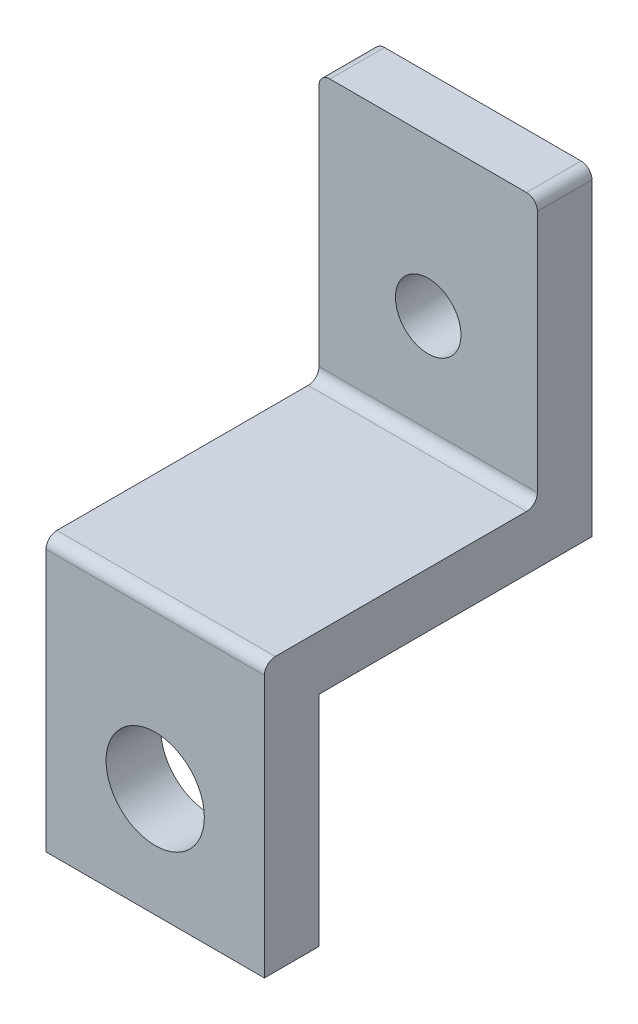
ISO-10303-21;
HEADER;
FILE_DESCRIPTION(('STEP AP214'),'2;1');
FILE_NAME('part.step','',(''),(''),'','','');
FILE_SCHEMA(('AUTOMOTIVE_DESIGN { 1 0 10303 214 1 1 1 1 }'));
ENDSEC;
DATA;
#1=APPLICATION_CONTEXT('core data for automotive mechanical design processes');
#2=APPLICATION_PROTOCOL_DEFINITION('international standard','automotive_design',2000,#1);
#3=PRODUCT_CONTEXT('',#1,'mechanical');
#4=PRODUCT('Part','Part','',(#3));
#5=PRODUCT_RELATED_PRODUCT_CATEGORY('part','',(#4));
#6=PRODUCT_DEFINITION_FORMATION('','',#4);
#7=PRODUCT_DEFINITION_CONTEXT('part definition',#1,'design');
#8=PRODUCT_DEFINITION('design','',#6,#7);
#9=PRODUCT_DEFINITION_SHAPE('','',#8);
#10=(LENGTH_UNIT() NAMED_UNIT(*) SI_UNIT(.MILLI.,.METRE.));
#11=(NAMED_UNIT(*) PLANE_ANGLE_UNIT() SI_UNIT($,.RADIAN.));
#12=(NAMED_UNIT(*) SI_UNIT($,.STERADIAN.) SOLID_ANGLE_UNIT());
#13=UNCERTAINTY_MEASURE_WITH_UNIT(LENGTH_MEASURE(1.E-05),#10,'distance_accuracy_value','');
#14=(GEOMETRIC_REPRESENTATION_CONTEXT(3) GLOBAL_UNCERTAINTY_ASSIGNED_CONTEXT((#13)) GLOBAL_UNIT_ASSIGNED_CONTEXT((#10,
#11,#12)) REPRESENTATION_CONTEXT('',''));
#15=CARTESIAN_POINT('',(0.,0.,0.));
#16=DIRECTION('',(0.,0.,1.));
#17=DIRECTION('',(1.,0.,0.));
#18=AXIS2_PLACEMENT_3D('',#15,#16,#17);
#19=CARTESIAN_POINT('',(0.,0.,0.));
#20=DIRECTION('',(0.,0.,1.));
#21=DIRECTION('',(1.,0.,0.));
#22=AXIS2_PLACEMENT_3D('',#19,#20,#21);
#23=PLANE('',#22);
#24=CARTESIAN_POINT('',(0.,0.,0.));
#25=DIRECTION('',(0.,0.,1.));
#26=DIRECTION('',(1.,0.,0.));
#27=AXIS2_PLACEMENT_3D('',#24,#25,#26);
#28=CIRCLE('',#27,4.5);
#29=CARTESIAN_POINT('',(4.5,0.,0.));
#30=VERTEX_POINT('',#29);
#31=EDGE_CURVE('E149',#30,#30,#28,.T.);
#32=ORIENTED_EDGE('',*,*,#31,.T.);
#33=EDGE_LOOP('',(#32));
#34=FACE_BOUND('',#33,.T.);
#35=DIRECTION('',(-1.,0.,0.));
#36=VECTOR('',#35,1.);
#37=CARTESIAN_POINT('',(10.,10.,0.));
#38=LINE('',#37,#36);
#39=CARTESIAN_POINT('',(10.,10.,0.));
#40=VERTEX_POINT('',#39);
#41=CARTESIAN_POINT('',(-9.99999999999999,10.,0.));
#42=VERTEX_POINT('',#41);
#43=EDGE_CURVE('E159',#40,#42,#38,.T.);
#44=ORIENTED_EDGE('',*,*,#43,.F.);
#45=DIRECTION('',(0.,1.,0.));
#46=VECTOR('',#45,1.);
#47=CARTESIAN_POINT('',(9.99999999999999,39.3,0.));
#48=LINE('',#47,#46);
#49=CARTESIAN_POINT('',(10.,-10.,0.));
#50=VERTEX_POINT('',#49);
#51=EDGE_CURVE('E146',#50,#40,#48,.T.);
#52=ORIENTED_EDGE('',*,*,#51,.F.);
#53=DIRECTION('',(1.,0.,0.));
#54=VECTOR('',#53,1.);
#55=CARTESIAN_POINT('',(-10.,-10.,0.));
#56=LINE('',#55,#54);
#57=CARTESIAN_POINT('',(-10.,-10.,0.));
#58=VERTEX_POINT('',#57);
#59=EDGE_CURVE('E171',#58,#50,#56,.T.);
#60=ORIENTED_EDGE('',*,*,#59,.F.);
#61=DIRECTION('',(0.,-1.,0.));
#62=VECTOR('',#61,1.);
#63=CARTESIAN_POINT('',(-10.,10.,0.));
#64=LINE('',#63,#62);
#65=EDGE_CURVE('E177',#42,#58,#64,.T.);
#66=ORIENTED_EDGE('',*,*,#65,.F.);
#67=EDGE_LOOP('',(#44,#52,#60,#66));
#68=FACE_BOUND('',#67,.T.);
#69=ADVANCED_FACE('F41',(#34,#68),#23,.F.);
#70=CARTESIAN_POINT('',(0.,0.,5.));
#71=DIRECTION('',(0.,0.,1.));
#72=DIRECTION('',(1.,0.,0.));
#73=AXIS2_PLACEMENT_3D('',#70,#71,#72);
#74=PLANE('',#73);
#75=DIRECTION('',(0.,1.,0.));
#76=VECTOR('',#75,1.);
#77=CARTESIAN_POINT('',(10.,10.,5.));
#78=LINE('',#77,#76);
#79=CARTESIAN_POINT('',(10.,-10.,5.));
#80=VERTEX_POINT('',#79);
#81=CARTESIAN_POINT('',(10.,14.,5.));
#82=VERTEX_POINT('',#81);
#83=EDGE_CURVE('E168',#80,#82,#78,.T.);
#84=ORIENTED_EDGE('',*,*,#83,.T.);
#85=DIRECTION('',(1.,0.,0.));
#86=VECTOR('',#85,1.);
#87=CARTESIAN_POINT('',(-10.,14.,5.));
#88=LINE('',#87,#86);
#89=CARTESIAN_POINT('',(-10.,14.,5.));
#90=VERTEX_POINT('',#89);
#91=EDGE_CURVE('E56',#82,#90,#88,.F.);
#92=ORIENTED_EDGE('',*,*,#91,.T.);
#93=DIRECTION('',(0.,-1.,0.));
#94=VECTOR('',#93,1.);
#95=CARTESIAN_POINT('',(-10.,39.3,5.));
#96=LINE('',#95,#94);
#97=CARTESIAN_POINT('',(-10.,-10.,5.));
#98=VERTEX_POINT('',#97);
#99=EDGE_CURVE('E170',#90,#98,#96,.T.);
#100=ORIENTED_EDGE('',*,*,#99,.T.);
#101=DIRECTION('',(1.,0.,0.));
#102=VECTOR('',#101,1.);
#103=CARTESIAN_POINT('',(-10.,-10.,5.));
#104=LINE('',#103,#102);
#105=EDGE_CURVE('E173',#98,#80,#104,.T.);
#106=ORIENTED_EDGE('',*,*,#105,.T.);
#107=EDGE_LOOP('',(#84,#92,#100,#106));
#108=FACE_BOUND('',#107,.T.);
#109=CARTESIAN_POINT('',(0.,0.,5.));
#110=DIRECTION('',(0.,0.,1.));
#111=DIRECTION('',(1.,0.,0.));
#112=AXIS2_PLACEMENT_3D('',#109,#110,#111);
#113=CIRCLE('',#112,4.5);
#114=CARTESIAN_POINT('',(4.5,0.,5.));
#115=VERTEX_POINT('',#114);
#116=EDGE_CURVE('E163',#115,#115,#113,.T.);
#117=ORIENTED_EDGE('',*,*,#116,.F.);
#118=EDGE_LOOP('',(#117));
#119=FACE_BOUND('',#118,.T.);
#120=ADVANCED_FACE('F271',(#108,#119),#74,.T.);
#121=CARTESIAN_POINT('',(9.99999999999999,39.3,5.));
#122=DIRECTION('',(-1.,0.,0.));
#123=DIRECTION('',(0.,-1.,0.));
#124=AXIS2_PLACEMENT_3D('',#121,#122,#123);
#125=PLANE('',#124);
#126=DIRECTION('',(0.,-1.,0.));
#127=VECTOR('',#126,1.);
#128=CARTESIAN_POINT('',(10.,39.3,-25.));
#129=LINE('',#128,#127);
#130=CARTESIAN_POINT('',(10.,38.3,-25.));
#131=VERTEX_POINT('',#130);
#132=CARTESIAN_POINT('',(10.,10.,-25.));
#133=VERTEX_POINT('',#132);
#134=EDGE_CURVE('E129',#131,#133,#129,.T.);
#135=ORIENTED_EDGE('',*,*,#134,.F.);
#136=DIRECTION('',(0.,0.,-1.));
#137=VECTOR('',#136,1.);
#138=CARTESIAN_POINT('',(9.99999999999999,38.3,5.));
#139=LINE('',#138,#137);
#140=CARTESIAN_POINT('',(10.,38.3,-20.));
#141=VERTEX_POINT('',#140);
#142=EDGE_CURVE('E212',#131,#141,#139,.F.);
#143=ORIENTED_EDGE('',*,*,#142,.T.);
#144=DIRECTION('',(0.,1.,0.));
#145=VECTOR('',#144,1.);
#146=CARTESIAN_POINT('',(10.,39.3,-20.));
#147=LINE('',#146,#145);
#148=CARTESIAN_POINT('',(10.,16.,-20.));
#149=VERTEX_POINT('',#148);
#150=EDGE_CURVE('E223',#149,#141,#147,.T.);
#151=ORIENTED_EDGE('',*,*,#150,.F.);
#152=CARTESIAN_POINT('',(9.99999999999999,16.,-19.));
#153=DIRECTION('',(-1.,0.,0.));
#154=DIRECTION('',(0.,-1.,0.));
#155=AXIS2_PLACEMENT_3D('',#152,#153,#154);
#156=CIRCLE('',#155,1.);
#157=CARTESIAN_POINT('',(10.,15.,-19.));
#158=VERTEX_POINT('',#157);
#159=EDGE_CURVE('E49',#149,#158,#156,.T.);
#160=ORIENTED_EDGE('',*,*,#159,.T.);
#161=DIRECTION('',(0.,0.,-1.));
#162=VECTOR('',#161,1.);
#163=CARTESIAN_POINT('',(10.,15.,0.));
#164=LINE('',#163,#162);
#165=CARTESIAN_POINT('',(10.,15.,4.));
#166=VERTEX_POINT('',#165);
#167=EDGE_CURVE('E221',#166,#158,#164,.T.);
#168=ORIENTED_EDGE('',*,*,#167,.F.);
#169=CARTESIAN_POINT('',(10.,14.,4.));
#170=DIRECTION('',(-1.,0.,0.));
#171=DIRECTION('',(0.,-1.,0.));
#172=AXIS2_PLACEMENT_3D('',#169,#170,#171);
#173=CIRCLE('',#172,1.);
#174=EDGE_CURVE('E64',#166,#82,#173,.F.);
#175=ORIENTED_EDGE('',*,*,#174,.T.);
#176=ORIENTED_EDGE('',*,*,#83,.F.);
#177=DIRECTION('',(0.,0.,-1.));
#178=VECTOR('',#177,1.);
#179=CARTESIAN_POINT('',(10.,-10.,5.));
#180=LINE('',#179,#178);
#181=EDGE_CURVE('E175',#80,#50,#180,.T.);
#182=ORIENTED_EDGE('',*,*,#181,.T.);
#183=ORIENTED_EDGE('',*,*,#51,.T.);
#184=DIRECTION('',(0.,0.,1.));
#185=VECTOR('',#184,1.);
#186=CARTESIAN_POINT('',(10.,10.,-25.));
#187=LINE('',#186,#185);
#188=EDGE_CURVE('E143',#133,#40,#187,.T.);
#189=ORIENTED_EDGE('',*,*,#188,.F.);
#190=EDGE_LOOP('',(#135,#143,#151,#160,#168,#175,#176,#182,#183,#189));
#191=FACE_BOUND('',#190,.T.);
#192=ADVANCED_FACE('F144',(#191),#125,.F.);
#193=CARTESIAN_POINT('',(9.99999999999999,39.3,5.));
#194=DIRECTION('',(0.,-1.,0.));
#195=DIRECTION('',(0.,0.,-1.));
#196=AXIS2_PLACEMENT_3D('',#193,#194,#195);
#197=PLANE('',#196);
#198=DIRECTION('',(1.,0.,0.));
#199=VECTOR('',#198,1.);
#200=CARTESIAN_POINT('',(-20.,39.3,-20.));
#201=LINE('',#200,#199);
#202=CARTESIAN_POINT('',(-9.00000000000001,39.3,-20.));
#203=VERTEX_POINT('',#202);
#204=CARTESIAN_POINT('',(8.99999999999999,39.3,-20.));
#205=VERTEX_POINT('',#204);
#206=EDGE_CURVE('E161',#203,#205,#201,.T.);
#207=ORIENTED_EDGE('',*,*,#206,.T.);
#208=DIRECTION('',(0.,0.,-1.));
#209=VECTOR('',#208,1.);
#210=CARTESIAN_POINT('',(8.99999999999999,39.3,5.));
#211=LINE('',#210,#209);
#212=CARTESIAN_POINT('',(8.99999999999999,39.3,-25.));
#213=VERTEX_POINT('',#212);
#214=EDGE_CURVE('E205',#205,#213,#211,.T.);
#215=ORIENTED_EDGE('',*,*,#214,.T.);
#216=DIRECTION('',(1.,0.,0.));
#217=VECTOR('',#216,1.);
#218=CARTESIAN_POINT('',(10.,39.3,-25.));
#219=LINE('',#218,#217);
#220=CARTESIAN_POINT('',(-9.00000000000001,39.3,-25.));
#221=VERTEX_POINT('',#220);
#222=EDGE_CURVE('E139',#221,#213,#219,.T.);
#223=ORIENTED_EDGE('',*,*,#222,.F.);
#224=DIRECTION('',(0.,0.,-1.));
#225=VECTOR('',#224,1.);
#226=CARTESIAN_POINT('',(-9.00000000000001,39.3,5.));
#227=LINE('',#226,#225);
#228=EDGE_CURVE('E203',#221,#203,#227,.F.);
#229=ORIENTED_EDGE('',*,*,#228,.T.);
#230=EDGE_LOOP('',(#207,#215,#223,#229));
#231=FACE_BOUND('',#230,.T.);
#232=ADVANCED_FACE('F288',(#231),#197,.F.);
#233=CARTESIAN_POINT('',(-10.,10.,5.));
#234=DIRECTION('',(1.,0.,0.));
#235=DIRECTION('',(0.,1.,0.));
#236=AXIS2_PLACEMENT_3D('',#233,#234,#235);
#237=PLANE('',#236);
#238=DIRECTION('',(0.,1.,0.));
#239=VECTOR('',#238,1.);
#240=CARTESIAN_POINT('',(-10.,10.,-20.));
#241=LINE('',#240,#239);
#242=CARTESIAN_POINT('',(-10.,16.,-20.));
#243=VERTEX_POINT('',#242);
#244=CARTESIAN_POINT('',(-10.,38.3,-20.));
#245=VERTEX_POINT('',#244);
#246=EDGE_CURVE('E185',#243,#245,#241,.T.);
#247=ORIENTED_EDGE('',*,*,#246,.T.);
#248=DIRECTION('',(0.,0.,-1.));
#249=VECTOR('',#248,1.);
#250=CARTESIAN_POINT('',(-10.,38.3,5.));
#251=LINE('',#250,#249);
#252=CARTESIAN_POINT('',(-9.99999999999999,38.3,-25.));
#253=VERTEX_POINT('',#252);
#254=EDGE_CURVE('E216',#245,#253,#251,.T.);
#255=ORIENTED_EDGE('',*,*,#254,.T.);
#256=DIRECTION('',(0.,1.,0.));
#257=VECTOR('',#256,1.);
#258=CARTESIAN_POINT('',(-9.99999999999999,39.3,-25.));
#259=LINE('',#258,#257);
#260=CARTESIAN_POINT('',(-9.99999999999999,10.,-25.));
#261=VERTEX_POINT('',#260);
#262=EDGE_CURVE('E160',#261,#253,#259,.T.);
#263=ORIENTED_EDGE('',*,*,#262,.F.);
#264=DIRECTION('',(0.,0.,1.));
#265=VECTOR('',#264,1.);
#266=CARTESIAN_POINT('',(-9.99999999999999,10.,-25.));
#267=LINE('',#266,#265);
#268=EDGE_CURVE('E150',#261,#42,#267,.T.);
#269=ORIENTED_EDGE('',*,*,#268,.T.);
#270=ORIENTED_EDGE('',*,*,#65,.T.);
#271=DIRECTION('',(0.,0.,-1.));
#272=VECTOR('',#271,1.);
#273=CARTESIAN_POINT('',(-10.,-10.,5.));
#274=LINE('',#273,#272);
#275=EDGE_CURVE('E182',#98,#58,#274,.T.);
#276=ORIENTED_EDGE('',*,*,#275,.F.);
#277=ORIENTED_EDGE('',*,*,#99,.F.);
#278=CARTESIAN_POINT('',(-10.,14.,4.));
#279=DIRECTION('',(1.,0.,0.));
#280=DIRECTION('',(0.,1.,0.));
#281=AXIS2_PLACEMENT_3D('',#278,#279,#280);
#282=CIRCLE('',#281,1.);
#283=CARTESIAN_POINT('',(-10.,15.,4.));
#284=VERTEX_POINT('',#283);
#285=EDGE_CURVE('E214',#90,#284,#282,.F.);
#286=ORIENTED_EDGE('',*,*,#285,.T.);
#287=DIRECTION('',(0.,0.,-1.));
#288=VECTOR('',#287,1.);
#289=CARTESIAN_POINT('',(-10.,15.,5.));
#290=LINE('',#289,#288);
#291=CARTESIAN_POINT('',(-10.,15.,-19.));
#292=VERTEX_POINT('',#291);
#293=EDGE_CURVE('E188',#284,#292,#290,.T.);
#294=ORIENTED_EDGE('',*,*,#293,.T.);
#295=CARTESIAN_POINT('',(-10.,16.,-19.));
#296=DIRECTION('',(1.,0.,0.));
#297=DIRECTION('',(0.,1.,0.));
#298=AXIS2_PLACEMENT_3D('',#295,#296,#297);
#299=CIRCLE('',#298,1.);
#300=EDGE_CURVE('E11',#292,#243,#299,.T.);
#301=ORIENTED_EDGE('',*,*,#300,.T.);
#302=EDGE_LOOP('',(#247,#255,#263,#269,#270,#276,#277,#286,#294,#301));
#303=FACE_BOUND('',#302,.T.);
#304=ADVANCED_FACE('F236',(#303),#237,.F.);
#305=CARTESIAN_POINT('',(-10.,-10.,5.));
#306=DIRECTION('',(0.,1.,0.));
#307=DIRECTION('',(0.,0.,1.));
#308=AXIS2_PLACEMENT_3D('',#305,#306,#307);
#309=PLANE('',#308);
#310=ORIENTED_EDGE('',*,*,#59,.T.);
#311=ORIENTED_EDGE('',*,*,#181,.F.);
#312=ORIENTED_EDGE('',*,*,#105,.F.);
#313=ORIENTED_EDGE('',*,*,#275,.T.);
#314=EDGE_LOOP('',(#310,#311,#312,#313));
#315=FACE_BOUND('',#314,.T.);
#316=ADVANCED_FACE('F281',(#315),#309,.F.);
#317=CARTESIAN_POINT('',(0.,0.,5.));
#318=DIRECTION('',(0.,0.,-1.));
#319=DIRECTION('',(-1.,0.,0.));
#320=AXIS2_PLACEMENT_3D('',#317,#318,#319);
#321=CYLINDRICAL_SURFACE('',#320,4.5);
#322=ORIENTED_EDGE('',*,*,#116,.T.);
#323=EDGE_LOOP('',(#322));
#324=FACE_BOUND('',#323,.T.);
#325=ORIENTED_EDGE('',*,*,#31,.F.);
#326=EDGE_LOOP('',(#325));
#327=FACE_BOUND('',#326,.T.);
#328=ADVANCED_FACE('F284',(#324,#327),#321,.F.);
#329=CARTESIAN_POINT('',(10.,10.,-25.));
#330=DIRECTION('',(0.,1.,0.));
#331=DIRECTION('',(0.,0.,1.));
#332=AXIS2_PLACEMENT_3D('',#329,#330,#331);
#333=PLANE('',#332);
#334=ORIENTED_EDGE('',*,*,#43,.T.);
#335=ORIENTED_EDGE('',*,*,#268,.F.);
#336=DIRECTION('',(-1.,0.,0.));
#337=VECTOR('',#336,1.);
#338=CARTESIAN_POINT('',(10.,10.,-25.));
#339=LINE('',#338,#337);
#340=EDGE_CURVE('E135',#133,#261,#339,.T.);
#341=ORIENTED_EDGE('',*,*,#340,.F.);
#342=ORIENTED_EDGE('',*,*,#188,.T.);
#343=EDGE_LOOP('',(#334,#335,#341,#342));
#344=FACE_BOUND('',#343,.T.);
#345=ADVANCED_FACE('F152',(#344),#333,.F.);
#346=CARTESIAN_POINT('',(0.,0.,-25.));
#347=DIRECTION('',(0.,0.,-1.));
#348=DIRECTION('',(-1.,0.,0.));
#349=AXIS2_PLACEMENT_3D('',#346,#347,#348);
#350=PLANE('',#349);
#351=CARTESIAN_POINT('',(0.,25.,-25.));
#352=DIRECTION('',(0.,0.,-1.));
#353=DIRECTION('',(-1.,0.,0.));
#354=AXIS2_PLACEMENT_3D('',#351,#352,#353);
#355=CIRCLE('',#354,3.);
#356=CARTESIAN_POINT('',(-3.,25.,-25.));
#357=VERTEX_POINT('',#356);
#358=EDGE_CURVE('E251',#357,#357,#355,.T.);
#359=ORIENTED_EDGE('',*,*,#358,.F.);
#360=EDGE_LOOP('',(#359));
#361=FACE_BOUND('',#360,.T.);
#362=ORIENTED_EDGE('',*,*,#222,.T.);
#363=CARTESIAN_POINT('',(8.99999999999999,38.3,-25.));
#364=DIRECTION('',(0.,0.,-1.));
#365=DIRECTION('',(-1.,0.,0.));
#366=AXIS2_PLACEMENT_3D('',#363,#364,#365);
#367=CIRCLE('',#366,1.);
#368=EDGE_CURVE('E137',#213,#131,#367,.T.);
#369=ORIENTED_EDGE('',*,*,#368,.T.);
#370=ORIENTED_EDGE('',*,*,#134,.T.);
#371=ORIENTED_EDGE('',*,*,#340,.T.);
#372=ORIENTED_EDGE('',*,*,#262,.T.);
#373=CARTESIAN_POINT('',(-9.00000000000001,38.3,-25.));
#374=DIRECTION('',(0.,0.,-1.));
#375=DIRECTION('',(-1.,0.,0.));
#376=AXIS2_PLACEMENT_3D('',#373,#374,#375);
#377=CIRCLE('',#376,1.);
#378=EDGE_CURVE('E208',#253,#221,#377,.T.);
#379=ORIENTED_EDGE('',*,*,#378,.T.);
#380=EDGE_LOOP('',(#362,#369,#370,#371,#372,#379));
#381=FACE_BOUND('',#380,.T.);
#382=ADVANCED_FACE('F132',(#361,#381),#350,.T.);
#383=CARTESIAN_POINT('',(-20.,15.,0.));
#384=DIRECTION('',(0.,-1.,0.));
#385=DIRECTION('',(1.,0.,0.));
#386=AXIS2_PLACEMENT_3D('',#383,#384,#385);
#387=PLANE('',#386);
#388=ORIENTED_EDGE('',*,*,#167,.T.);
#389=DIRECTION('',(1.,0.,0.));
#390=VECTOR('',#389,1.);
#391=CARTESIAN_POINT('',(-10.,15.,-19.));
#392=LINE('',#391,#390);
#393=EDGE_CURVE('E201',#158,#292,#392,.F.);
#394=ORIENTED_EDGE('',*,*,#393,.T.);
#395=ORIENTED_EDGE('',*,*,#293,.F.);
#396=DIRECTION('',(1.,0.,0.));
#397=VECTOR('',#396,1.);
#398=CARTESIAN_POINT('',(10.,15.,4.));
#399=LINE('',#398,#397);
#400=EDGE_CURVE('E198',#284,#166,#399,.T.);
#401=ORIENTED_EDGE('',*,*,#400,.T.);
#402=EDGE_LOOP('',(#388,#394,#395,#401));
#403=FACE_BOUND('',#402,.T.);
#404=ADVANCED_FACE('F228',(#403),#387,.F.);
#405=CARTESIAN_POINT('',(-20.,39.3,-20.));
#406=DIRECTION('',(0.,0.,-1.));
#407=DIRECTION('',(-1.,0.,0.));
#408=AXIS2_PLACEMENT_3D('',#405,#406,#407);
#409=PLANE('',#408);
#410=CARTESIAN_POINT('',(0.,25.,-20.));
#411=DIRECTION('',(0.,0.,1.));
#412=DIRECTION('',(1.,0.,0.));
#413=AXIS2_PLACEMENT_3D('',#410,#411,#412);
#414=CIRCLE('',#413,3.);
#415=CARTESIAN_POINT('',(3.,25.,-20.));
#416=VERTEX_POINT('',#415);
#417=EDGE_CURVE('E254',#416,#416,#414,.T.);
#418=ORIENTED_EDGE('',*,*,#417,.F.);
#419=EDGE_LOOP('',(#418));
#420=FACE_BOUND('',#419,.T.);
#421=ORIENTED_EDGE('',*,*,#246,.F.);
#422=DIRECTION('',(1.,0.,0.));
#423=VECTOR('',#422,1.);
#424=CARTESIAN_POINT('',(10.,16.,-20.));
#425=LINE('',#424,#423);
#426=EDGE_CURVE('E195',#243,#149,#425,.T.);
#427=ORIENTED_EDGE('',*,*,#426,.T.);
#428=ORIENTED_EDGE('',*,*,#150,.T.);
#429=CARTESIAN_POINT('',(8.99999999999999,38.3,-20.));
#430=DIRECTION('',(0.,0.,-1.));
#431=DIRECTION('',(-1.,0.,0.));
#432=AXIS2_PLACEMENT_3D('',#429,#430,#431);
#433=CIRCLE('',#432,1.);
#434=EDGE_CURVE('E193',#141,#205,#433,.F.);
#435=ORIENTED_EDGE('',*,*,#434,.T.);
#436=ORIENTED_EDGE('',*,*,#206,.F.);
#437=CARTESIAN_POINT('',(-9.00000000000001,38.3,-20.));
#438=DIRECTION('',(0.,0.,-1.));
#439=DIRECTION('',(-1.,0.,0.));
#440=AXIS2_PLACEMENT_3D('',#437,#438,#439);
#441=CIRCLE('',#440,1.);
#442=EDGE_CURVE('E191',#203,#245,#441,.F.);
#443=ORIENTED_EDGE('',*,*,#442,.T.);
#444=EDGE_LOOP('',(#421,#427,#428,#435,#436,#443));
#445=FACE_BOUND('',#444,.T.);
#446=ADVANCED_FACE('F239',(#420,#445),#409,.F.);
#447=CARTESIAN_POINT('',(0.,25.,-50.));
#448=DIRECTION('',(0.,0.,1.));
#449=DIRECTION('',(1.,0.,0.));
#450=AXIS2_PLACEMENT_3D('',#447,#448,#449);
#451=CYLINDRICAL_SURFACE('',#450,3.);
#452=ORIENTED_EDGE('',*,*,#358,.T.);
#453=EDGE_LOOP('',(#452));
#454=FACE_BOUND('',#453,.T.);
#455=ORIENTED_EDGE('',*,*,#417,.T.);
#456=EDGE_LOOP('',(#455));
#457=FACE_BOUND('',#456,.T.);
#458=ADVANCED_FACE('F258',(#454,#457),#451,.F.);
#459=CARTESIAN_POINT('',(-20.,16.,-19.));
#460=DIRECTION('',(-1.,0.,0.));
#461=DIRECTION('',(0.,-1.,0.));
#462=AXIS2_PLACEMENT_3D('',#459,#460,#461);
#463=CYLINDRICAL_SURFACE('',#462,1.);
#464=ORIENTED_EDGE('',*,*,#300,.F.);
#465=ORIENTED_EDGE('',*,*,#393,.F.);
#466=ORIENTED_EDGE('',*,*,#159,.F.);
#467=ORIENTED_EDGE('',*,*,#426,.F.);
#468=EDGE_LOOP('',(#464,#465,#466,#467));
#469=FACE_BOUND('',#468,.T.);
#470=ADVANCED_FACE('F233',(#469),#463,.F.);
#471=CARTESIAN_POINT('',(8.99999999999999,38.3,5.));
#472=DIRECTION('',(0.,0.,-1.));
#473=DIRECTION('',(-1.,0.,0.));
#474=AXIS2_PLACEMENT_3D('',#471,#472,#473);
#475=CYLINDRICAL_SURFACE('',#474,1.);
#476=ORIENTED_EDGE('',*,*,#434,.F.);
#477=ORIENTED_EDGE('',*,*,#142,.F.);
#478=ORIENTED_EDGE('',*,*,#368,.F.);
#479=ORIENTED_EDGE('',*,*,#214,.F.);
#480=EDGE_LOOP('',(#476,#477,#478,#479));
#481=FACE_BOUND('',#480,.T.);
#482=ADVANCED_FACE('F296',(#481),#475,.T.);
#483=CARTESIAN_POINT('',(-9.00000000000001,38.3,5.));
#484=DIRECTION('',(0.,0.,-1.));
#485=DIRECTION('',(-1.,0.,0.));
#486=AXIS2_PLACEMENT_3D('',#483,#484,#485);
#487=CYLINDRICAL_SURFACE('',#486,1.);
#488=ORIENTED_EDGE('',*,*,#442,.F.);
#489=ORIENTED_EDGE('',*,*,#228,.F.);
#490=ORIENTED_EDGE('',*,*,#378,.F.);
#491=ORIENTED_EDGE('',*,*,#254,.F.);
#492=EDGE_LOOP('',(#488,#489,#490,#491));
#493=FACE_BOUND('',#492,.T.);
#494=ADVANCED_FACE('F245',(#493),#487,.T.);
#495=CARTESIAN_POINT('',(-20.,14.,4.));
#496=DIRECTION('',(-1.,0.,0.));
#497=DIRECTION('',(0.,-1.,0.));
#498=AXIS2_PLACEMENT_3D('',#495,#496,#497);
#499=CYLINDRICAL_SURFACE('',#498,1.);
#500=ORIENTED_EDGE('',*,*,#285,.F.);
#501=ORIENTED_EDGE('',*,*,#91,.F.);
#502=ORIENTED_EDGE('',*,*,#174,.F.);
#503=ORIENTED_EDGE('',*,*,#400,.F.);
#504=EDGE_LOOP('',(#500,#501,#502,#503));
#505=FACE_BOUND('',#504,.T.);
#506=ADVANCED_FACE('F43',(#505),#499,.T.);
#507=CLOSED_SHELL('',(#69,#120,#192,#232,#304,#316,#328,#345,#382,#404,#446,#458,#470,#482,#494,#506));
#508=MANIFOLD_SOLID_BREP('B2',#507);
#509=ADVANCED_BREP_SHAPE_REPRESENTATION('',(#18,#508),#14);
#510=SHAPE_DEFINITION_REPRESENTATION(#9,#509);
ENDSEC;
END-ISO-10303-21;
